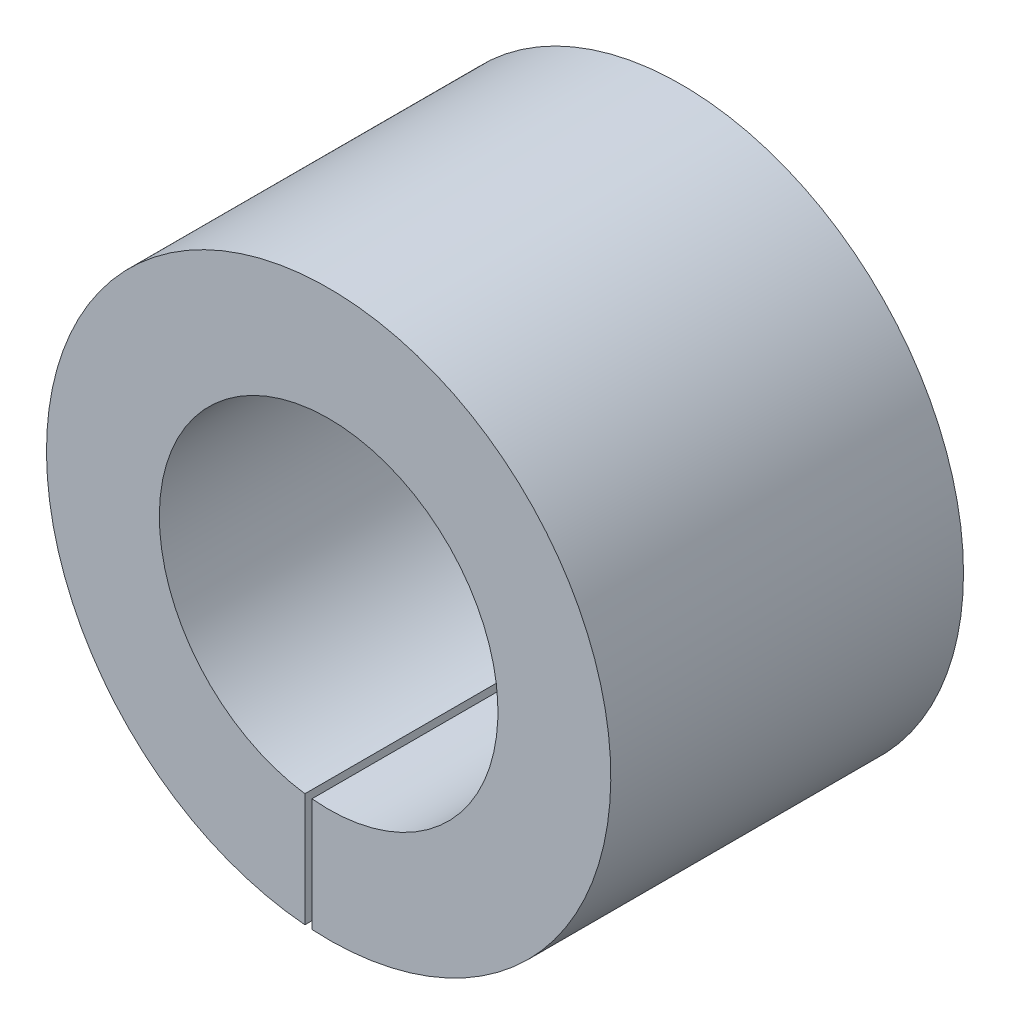
ISO-10303-21;
HEADER;
FILE_DESCRIPTION(('STEP AP214'),'2;1');
FILE_NAME('part.step','',(''),(''),'','','');
FILE_SCHEMA(('AUTOMOTIVE_DESIGN { 1 0 10303 214 1 1 1 1 }'));
ENDSEC;
DATA;
#1=APPLICATION_CONTEXT('core data for automotive mechanical design processes');
#2=APPLICATION_PROTOCOL_DEFINITION('international standard','automotive_design',2000,#1);
#3=PRODUCT_CONTEXT('',#1,'mechanical');
#4=PRODUCT('Part','Part','',(#3));
#5=PRODUCT_RELATED_PRODUCT_CATEGORY('part','',(#4));
#6=PRODUCT_DEFINITION_FORMATION('','',#4);
#7=PRODUCT_DEFINITION_CONTEXT('part definition',#1,'design');
#8=PRODUCT_DEFINITION('design','',#6,#7);
#9=PRODUCT_DEFINITION_SHAPE('','',#8);
#10=(LENGTH_UNIT() NAMED_UNIT(*) SI_UNIT(.MILLI.,.METRE.));
#11=(NAMED_UNIT(*) PLANE_ANGLE_UNIT() SI_UNIT($,.RADIAN.));
#12=(NAMED_UNIT(*) SI_UNIT($,.STERADIAN.) SOLID_ANGLE_UNIT());
#13=UNCERTAINTY_MEASURE_WITH_UNIT(LENGTH_MEASURE(1.E-05),#10,'distance_accuracy_value','');
#14=(GEOMETRIC_REPRESENTATION_CONTEXT(3) GLOBAL_UNCERTAINTY_ASSIGNED_CONTEXT((#13)) GLOBAL_UNIT_ASSIGNED_CONTEXT((#10,
#11,#12)) REPRESENTATION_CONTEXT('',''));
#15=CARTESIAN_POINT('',(0.,0.,0.));
#16=DIRECTION('',(0.,0.,1.));
#17=DIRECTION('',(1.,0.,0.));
#18=AXIS2_PLACEMENT_3D('',#15,#16,#17);
#19=CARTESIAN_POINT('',(0.,0.,25.));
#20=DIRECTION('',(0.,0.,1.));
#21=DIRECTION('',(1.,0.,0.));
#22=AXIS2_PLACEMENT_3D('',#19,#20,#21);
#23=PLANE('',#22);
#24=DIRECTION('',(0.,1.,0.));
#25=VECTOR('',#24,1.);
#26=CARTESIAN_POINT('',(-1.18457475729294,-2.26315991341753,25.));
#27=LINE('',#26,#25);
#28=CARTESIAN_POINT('',(-1.18457475729294,-19.9648887461059,25.));
#29=VERTEX_POINT('',#28);
#30=CARTESIAN_POINT('',(-1.18457475729294,-11.9413894771247,25.));
#31=VERTEX_POINT('',#30);
#32=EDGE_CURVE('E140',#29,#31,#27,.T.);
#33=ORIENTED_EDGE('',*,*,#32,.F.);
#34=CARTESIAN_POINT('',(0.,0.,25.));
#35=DIRECTION('',(0.,0.,1.));
#36=DIRECTION('',(1.,0.,0.));
#37=AXIS2_PLACEMENT_3D('',#34,#35,#36);
#38=CIRCLE('',#37,20.);
#39=CARTESIAN_POINT('',(-1.68457475729294,-19.928928919716,25.));
#40=VERTEX_POINT('',#39);
#41=EDGE_CURVE('E173',#29,#40,#38,.T.);
#42=ORIENTED_EDGE('',*,*,#41,.T.);
#43=DIRECTION('',(0.,-1.,0.));
#44=VECTOR('',#43,1.);
#45=CARTESIAN_POINT('',(-1.68457475729294,-2.26315991341753,25.));
#46=LINE('',#45,#44);
#47=CARTESIAN_POINT('',(-1.68457475729294,-11.8811703079744,25.));
#48=VERTEX_POINT('',#47);
#49=EDGE_CURVE('E145',#48,#40,#46,.T.);
#50=ORIENTED_EDGE('',*,*,#49,.F.);
#51=CARTESIAN_POINT('',(0.,0.,25.));
#52=DIRECTION('',(0.,0.,1.));
#53=DIRECTION('',(1.,0.,0.));
#54=AXIS2_PLACEMENT_3D('',#51,#52,#53);
#55=CIRCLE('',#54,12.);
#56=EDGE_CURVE('E165',#31,#48,#55,.T.);
#57=ORIENTED_EDGE('',*,*,#56,.F.);
#58=EDGE_LOOP('',(#33,#42,#50,#57));
#59=FACE_BOUND('',#58,.T.);
#60=ADVANCED_FACE('F39',(#59),#23,.T.);
#61=CARTESIAN_POINT('',(0.,0.,0.));
#62=DIRECTION('',(0.,0.,1.));
#63=DIRECTION('',(1.,0.,0.));
#64=AXIS2_PLACEMENT_3D('',#61,#62,#63);
#65=PLANE('',#64);
#66=CARTESIAN_POINT('',(0.,0.,0.));
#67=DIRECTION('',(0.,0.,1.));
#68=DIRECTION('',(1.,0.,0.));
#69=AXIS2_PLACEMENT_3D('',#66,#67,#68);
#70=CIRCLE('',#69,20.);
#71=CARTESIAN_POINT('',(20.,0.,0.));
#72=VERTEX_POINT('',#71);
#73=EDGE_CURVE('E169',#72,#72,#70,.T.);
#74=ORIENTED_EDGE('',*,*,#73,.F.);
#75=EDGE_LOOP('',(#74));
#76=FACE_BOUND('',#75,.T.);
#77=DIRECTION('',(1.,0.,0.));
#78=VECTOR('',#77,1.);
#79=CARTESIAN_POINT('',(0.919659449414419,18.1269717792472,0.));
#80=LINE('',#79,#78);
#81=CARTESIAN_POINT('',(0.419659449414419,18.1269717792472,0.));
#82=VERTEX_POINT('',#81);
#83=CARTESIAN_POINT('',(0.919659449414419,18.1269717792472,0.));
#84=VERTEX_POINT('',#83);
#85=EDGE_CURVE('E134',#82,#84,#80,.T.);
#86=ORIENTED_EDGE('',*,*,#85,.F.);
#87=DIRECTION('',(0.,1.,0.));
#88=VECTOR('',#87,1.);
#89=CARTESIAN_POINT('',(0.419659449414419,-2.68637365486835,0.));
#90=LINE('',#89,#88);
#91=CARTESIAN_POINT('',(0.419659449414419,11.9926596694193,0.));
#92=VERTEX_POINT('',#91);
#93=EDGE_CURVE('E119',#92,#82,#90,.T.);
#94=ORIENTED_EDGE('',*,*,#93,.F.);
#95=CARTESIAN_POINT('',(0.,0.,0.));
#96=DIRECTION('',(0.,0.,1.));
#97=DIRECTION('',(1.,0.,0.));
#98=AXIS2_PLACEMENT_3D('',#95,#96,#97);
#99=CIRCLE('',#98,12.);
#100=CARTESIAN_POINT('',(0.919659449414419,11.9647075391379,0.));
#101=VERTEX_POINT('',#100);
#102=EDGE_CURVE('E164',#92,#101,#99,.T.);
#103=ORIENTED_EDGE('',*,*,#102,.T.);
#104=DIRECTION('',(0.,-1.,0.));
#105=VECTOR('',#104,1.);
#106=CARTESIAN_POINT('',(0.919659449414419,-2.68637365486835,0.));
#107=LINE('',#106,#105);
#108=EDGE_CURVE('E113',#84,#101,#107,.T.);
#109=ORIENTED_EDGE('',*,*,#108,.F.);
#110=EDGE_LOOP('',(#86,#94,#103,#109));
#111=FACE_BOUND('',#110,.T.);
#112=ADVANCED_FACE('F201',(#76,#111),#65,.F.);
#113=CARTESIAN_POINT('',(0.,0.,25.));
#114=DIRECTION('',(0.,0.,-1.));
#115=DIRECTION('',(-1.,0.,0.));
#116=AXIS2_PLACEMENT_3D('',#113,#114,#115);
#117=CYLINDRICAL_SURFACE('',#116,20.);
#118=ORIENTED_EDGE('',*,*,#41,.F.);
#119=DIRECTION('',(0.,0.,-1.));
#120=VECTOR('',#119,1.);
#121=CARTESIAN_POINT('',(-1.18457475729294,-19.9648887461059,25.));
#122=LINE('',#121,#120);
#123=CARTESIAN_POINT('',(-1.18457475729294,-19.9648887461059,10.));
#124=VERTEX_POINT('',#123);
#125=EDGE_CURVE('E160',#29,#124,#122,.T.);
#126=ORIENTED_EDGE('',*,*,#125,.T.);
#127=CARTESIAN_POINT('',(0.,0.,10.));
#128=DIRECTION('',(0.,0.,1.));
#129=DIRECTION('',(1.,0.,0.));
#130=AXIS2_PLACEMENT_3D('',#127,#128,#129);
#131=CIRCLE('',#130,20.);
#132=CARTESIAN_POINT('',(-1.68457475729294,-19.928928919716,10.));
#133=VERTEX_POINT('',#132);
#134=EDGE_CURVE('E149',#133,#124,#131,.T.);
#135=ORIENTED_EDGE('',*,*,#134,.F.);
#136=DIRECTION('',(0.,0.,-1.));
#137=VECTOR('',#136,1.);
#138=CARTESIAN_POINT('',(-1.68457475729294,-19.928928919716,25.));
#139=LINE('',#138,#137);
#140=EDGE_CURVE('E156',#133,#40,#139,.F.);
#141=ORIENTED_EDGE('',*,*,#140,.T.);
#142=EDGE_LOOP('',(#118,#126,#135,#141));
#143=FACE_BOUND('',#142,.T.);
#144=ORIENTED_EDGE('',*,*,#73,.T.);
#145=EDGE_LOOP('',(#144));
#146=FACE_BOUND('',#145,.T.);
#147=ADVANCED_FACE('F41',(#143,#146),#117,.T.);
#148=CARTESIAN_POINT('',(0.,0.,25.));
#149=DIRECTION('',(0.,0.,-1.));
#150=DIRECTION('',(-1.,0.,0.));
#151=AXIS2_PLACEMENT_3D('',#148,#149,#150);
#152=CYLINDRICAL_SURFACE('',#151,12.);
#153=DIRECTION('',(0.,0.,-1.));
#154=VECTOR('',#153,1.);
#155=CARTESIAN_POINT('',(0.419659449414419,11.9926596694193,25.));
#156=LINE('',#155,#154);
#157=CARTESIAN_POINT('',(0.419659449414419,11.9926596694193,15.));
#158=VERTEX_POINT('',#157);
#159=EDGE_CURVE('E11',#158,#92,#156,.T.);
#160=ORIENTED_EDGE('',*,*,#159,.F.);
#161=CARTESIAN_POINT('',(0.,0.,15.));
#162=DIRECTION('',(0.,0.,1.));
#163=DIRECTION('',(1.,0.,0.));
#164=AXIS2_PLACEMENT_3D('',#161,#162,#163);
#165=CIRCLE('',#164,12.);
#166=CARTESIAN_POINT('',(0.919659449414419,11.9647075391379,15.));
#167=VERTEX_POINT('',#166);
#168=EDGE_CURVE('E109',#167,#158,#165,.T.);
#169=ORIENTED_EDGE('',*,*,#168,.F.);
#170=DIRECTION('',(0.,0.,-1.));
#171=VECTOR('',#170,1.);
#172=CARTESIAN_POINT('',(0.919659449414419,11.9647075391379,25.));
#173=LINE('',#172,#171);
#174=EDGE_CURVE('E48',#101,#167,#173,.F.);
#175=ORIENTED_EDGE('',*,*,#174,.F.);
#176=ORIENTED_EDGE('',*,*,#102,.F.);
#177=EDGE_LOOP('',(#160,#169,#175,#176));
#178=FACE_BOUND('',#177,.T.);
#179=DIRECTION('',(0.,0.,-1.));
#180=VECTOR('',#179,1.);
#181=CARTESIAN_POINT('',(-1.18457475729294,-11.9413894771247,25.));
#182=LINE('',#181,#180);
#183=CARTESIAN_POINT('',(-1.18457475729294,-11.9413894771247,10.));
#184=VERTEX_POINT('',#183);
#185=EDGE_CURVE('E187',#31,#184,#182,.T.);
#186=ORIENTED_EDGE('',*,*,#185,.F.);
#187=ORIENTED_EDGE('',*,*,#56,.T.);
#188=DIRECTION('',(0.,0.,-1.));
#189=VECTOR('',#188,1.);
#190=CARTESIAN_POINT('',(-1.68457475729294,-11.8811703079744,25.));
#191=LINE('',#190,#189);
#192=CARTESIAN_POINT('',(-1.68457475729294,-11.8811703079744,10.));
#193=VERTEX_POINT('',#192);
#194=EDGE_CURVE('E184',#193,#48,#191,.F.);
#195=ORIENTED_EDGE('',*,*,#194,.F.);
#196=CARTESIAN_POINT('',(0.,0.,10.));
#197=DIRECTION('',(0.,0.,1.));
#198=DIRECTION('',(1.,0.,0.));
#199=AXIS2_PLACEMENT_3D('',#196,#197,#198);
#200=CIRCLE('',#199,12.);
#201=EDGE_CURVE('E177',#193,#184,#200,.T.);
#202=ORIENTED_EDGE('',*,*,#201,.T.);
#203=EDGE_LOOP('',(#186,#187,#195,#202));
#204=FACE_BOUND('',#203,.T.);
#205=ADVANCED_FACE('F198',(#178,#204),#152,.F.);
#206=CARTESIAN_POINT('',(-1.18457475729294,-2.26315991341753,10.));
#207=DIRECTION('',(1.,0.,0.));
#208=DIRECTION('',(0.,1.,0.));
#209=AXIS2_PLACEMENT_3D('',#206,#207,#208);
#210=PLANE('',#209);
#211=ORIENTED_EDGE('',*,*,#32,.T.);
#212=ORIENTED_EDGE('',*,*,#185,.T.);
#213=DIRECTION('',(0.,1.,0.));
#214=VECTOR('',#213,1.);
#215=CARTESIAN_POINT('',(-1.18457475729294,-2.26315991341753,10.));
#216=LINE('',#215,#214);
#217=EDGE_CURVE('E63',#124,#184,#216,.T.);
#218=ORIENTED_EDGE('',*,*,#217,.F.);
#219=ORIENTED_EDGE('',*,*,#125,.F.);
#220=EDGE_LOOP('',(#211,#212,#218,#219));
#221=FACE_BOUND('',#220,.T.);
#222=ADVANCED_FACE('F215',(#221),#210,.F.);
#223=CARTESIAN_POINT('',(-1.68457475729294,-2.26315991341753,10.));
#224=DIRECTION('',(-1.,0.,0.));
#225=DIRECTION('',(0.,-1.,0.));
#226=AXIS2_PLACEMENT_3D('',#223,#224,#225);
#227=PLANE('',#226);
#228=DIRECTION('',(0.,-1.,0.));
#229=VECTOR('',#228,1.);
#230=CARTESIAN_POINT('',(-1.68457475729294,-2.26315991341753,10.));
#231=LINE('',#230,#229);
#232=EDGE_CURVE('E144',#193,#133,#231,.T.);
#233=ORIENTED_EDGE('',*,*,#232,.F.);
#234=ORIENTED_EDGE('',*,*,#194,.T.);
#235=ORIENTED_EDGE('',*,*,#49,.T.);
#236=ORIENTED_EDGE('',*,*,#140,.F.);
#237=EDGE_LOOP('',(#233,#234,#235,#236));
#238=FACE_BOUND('',#237,.T.);
#239=ADVANCED_FACE('F218',(#238),#227,.F.);
#240=CARTESIAN_POINT('',(0.,0.,10.));
#241=DIRECTION('',(0.,0.,1.));
#242=DIRECTION('',(1.,0.,0.));
#243=AXIS2_PLACEMENT_3D('',#240,#241,#242);
#244=PLANE('',#243);
#245=ORIENTED_EDGE('',*,*,#134,.T.);
#246=ORIENTED_EDGE('',*,*,#217,.T.);
#247=ORIENTED_EDGE('',*,*,#201,.F.);
#248=ORIENTED_EDGE('',*,*,#232,.T.);
#249=EDGE_LOOP('',(#245,#246,#247,#248));
#250=FACE_BOUND('',#249,.T.);
#251=ADVANCED_FACE('F222',(#250),#244,.T.);
#252=CARTESIAN_POINT('',(0.419659449414419,-2.68637365486835,15.));
#253=DIRECTION('',(-1.,0.,0.));
#254=DIRECTION('',(0.,0.,1.));
#255=AXIS2_PLACEMENT_3D('',#252,#253,#254);
#256=PLANE('',#255);
#257=ORIENTED_EDGE('',*,*,#159,.T.);
#258=ORIENTED_EDGE('',*,*,#93,.T.);
#259=DIRECTION('',(0.,0.,-1.));
#260=VECTOR('',#259,1.);
#261=CARTESIAN_POINT('',(0.419659449414419,18.1269717792472,15.));
#262=LINE('',#261,#260);
#263=CARTESIAN_POINT('',(0.419659449414419,18.1269717792472,15.));
#264=VERTEX_POINT('',#263);
#265=EDGE_CURVE('E116',#264,#82,#262,.T.);
#266=ORIENTED_EDGE('',*,*,#265,.F.);
#267=DIRECTION('',(0.,1.,0.));
#268=VECTOR('',#267,1.);
#269=CARTESIAN_POINT('',(0.419659449414419,-2.68637365486835,15.));
#270=LINE('',#269,#268);
#271=EDGE_CURVE('E103',#158,#264,#270,.T.);
#272=ORIENTED_EDGE('',*,*,#271,.F.);
#273=EDGE_LOOP('',(#257,#258,#266,#272));
#274=FACE_BOUND('',#273,.T.);
#275=ADVANCED_FACE('F117',(#274),#256,.F.);
#276=CARTESIAN_POINT('',(0.919659449414419,-2.68637365486835,15.));
#277=DIRECTION('',(1.,0.,0.));
#278=DIRECTION('',(0.,0.,-1.));
#279=AXIS2_PLACEMENT_3D('',#276,#277,#278);
#280=PLANE('',#279);
#281=ORIENTED_EDGE('',*,*,#174,.T.);
#282=DIRECTION('',(0.,-1.,0.));
#283=VECTOR('',#282,1.);
#284=CARTESIAN_POINT('',(0.919659449414419,-2.68637365486835,15.));
#285=LINE('',#284,#283);
#286=CARTESIAN_POINT('',(0.919659449414419,18.1269717792472,15.));
#287=VERTEX_POINT('',#286);
#288=EDGE_CURVE('E55',#287,#167,#285,.T.);
#289=ORIENTED_EDGE('',*,*,#288,.F.);
#290=DIRECTION('',(0.,0.,-1.));
#291=VECTOR('',#290,1.);
#292=CARTESIAN_POINT('',(0.919659449414419,18.1269717792472,15.));
#293=LINE('',#292,#291);
#294=EDGE_CURVE('E124',#287,#84,#293,.T.);
#295=ORIENTED_EDGE('',*,*,#294,.T.);
#296=ORIENTED_EDGE('',*,*,#108,.T.);
#297=EDGE_LOOP('',(#281,#289,#295,#296));
#298=FACE_BOUND('',#297,.T.);
#299=ADVANCED_FACE('F194',(#298),#280,.F.);
#300=CARTESIAN_POINT('',(0.919659449414419,18.1269717792472,15.));
#301=DIRECTION('',(0.,1.,0.));
#302=DIRECTION('',(0.,0.,1.));
#303=AXIS2_PLACEMENT_3D('',#300,#301,#302);
#304=PLANE('',#303);
#305=ORIENTED_EDGE('',*,*,#85,.T.);
#306=ORIENTED_EDGE('',*,*,#294,.F.);
#307=DIRECTION('',(1.,0.,0.));
#308=VECTOR('',#307,1.);
#309=CARTESIAN_POINT('',(0.919659449414419,18.1269717792472,15.));
#310=LINE('',#309,#308);
#311=EDGE_CURVE('E107',#264,#287,#310,.T.);
#312=ORIENTED_EDGE('',*,*,#311,.F.);
#313=ORIENTED_EDGE('',*,*,#265,.T.);
#314=EDGE_LOOP('',(#305,#306,#312,#313));
#315=FACE_BOUND('',#314,.T.);
#316=ADVANCED_FACE('F126',(#315),#304,.F.);
#317=CARTESIAN_POINT('',(0.,0.,15.));
#318=DIRECTION('',(0.,0.,1.));
#319=DIRECTION('',(1.,0.,0.));
#320=AXIS2_PLACEMENT_3D('',#317,#318,#319);
#321=PLANE('',#320);
#322=ORIENTED_EDGE('',*,*,#168,.T.);
#323=ORIENTED_EDGE('',*,*,#271,.T.);
#324=ORIENTED_EDGE('',*,*,#311,.T.);
#325=ORIENTED_EDGE('',*,*,#288,.T.);
#326=EDGE_LOOP('',(#322,#323,#324,#325));
#327=FACE_BOUND('',#326,.T.);
#328=ADVANCED_FACE('F105',(#327),#321,.F.);
#329=CLOSED_SHELL('',(#60,#112,#147,#205,#222,#239,#251,#275,#299,#316,#328));
#330=MANIFOLD_SOLID_BREP('B2',#329);
#331=ADVANCED_BREP_SHAPE_REPRESENTATION('',(#18,#330),#14);
#332=SHAPE_DEFINITION_REPRESENTATION(#9,#331);
ENDSEC;
END-ISO-10303-21;
